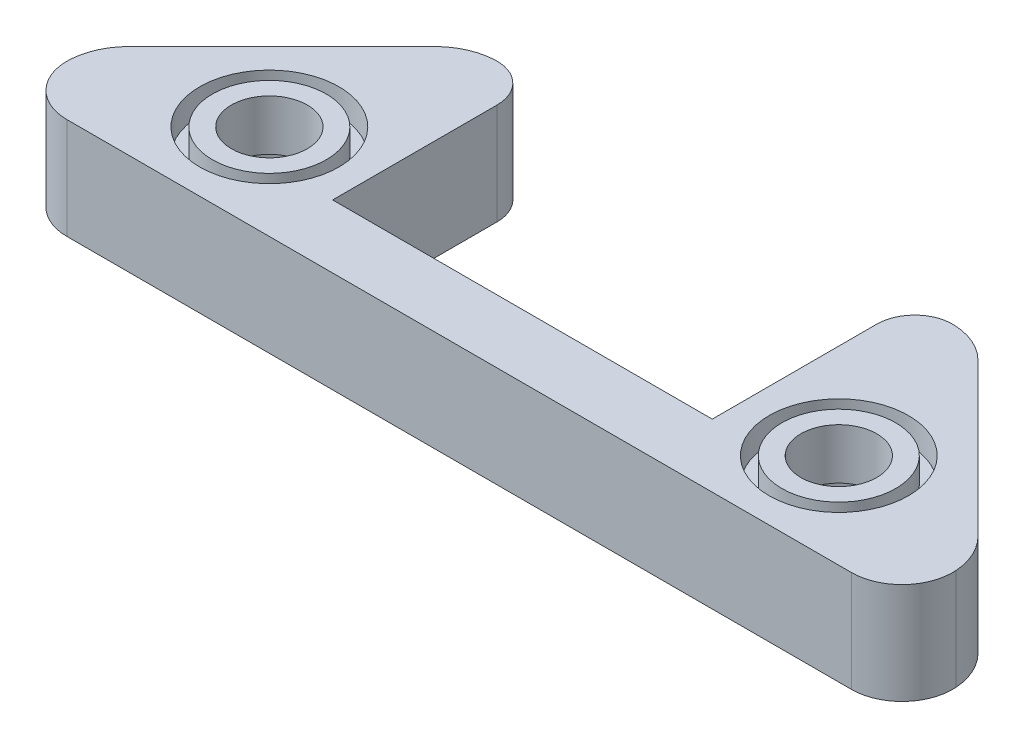
ISO-10303-21;
HEADER;
FILE_DESCRIPTION(('STEP AP214'),'2;1');
FILE_NAME('part.step','',(''),(''),'','','');
FILE_SCHEMA(('AUTOMOTIVE_DESIGN { 1 0 10303 214 1 1 1 1 }'));
ENDSEC;
DATA;
#1=APPLICATION_CONTEXT('core data for automotive mechanical design processes');
#2=APPLICATION_PROTOCOL_DEFINITION('international standard','automotive_design',2000,#1);
#3=PRODUCT_CONTEXT('',#1,'mechanical');
#4=PRODUCT('Part','Part','',(#3));
#5=PRODUCT_RELATED_PRODUCT_CATEGORY('part','',(#4));
#6=PRODUCT_DEFINITION_FORMATION('','',#4);
#7=PRODUCT_DEFINITION_CONTEXT('part definition',#1,'design');
#8=PRODUCT_DEFINITION('design','',#6,#7);
#9=PRODUCT_DEFINITION_SHAPE('','',#8);
#10=(LENGTH_UNIT() NAMED_UNIT(*) SI_UNIT(.MILLI.,.METRE.));
#11=(NAMED_UNIT(*) PLANE_ANGLE_UNIT() SI_UNIT($,.RADIAN.));
#12=(NAMED_UNIT(*) SI_UNIT($,.STERADIAN.) SOLID_ANGLE_UNIT());
#13=UNCERTAINTY_MEASURE_WITH_UNIT(LENGTH_MEASURE(1.E-05),#10,'distance_accuracy_value','');
#14=(GEOMETRIC_REPRESENTATION_CONTEXT(3) GLOBAL_UNCERTAINTY_ASSIGNED_CONTEXT((#13)) GLOBAL_UNIT_ASSIGNED_CONTEXT((#10,
#11,#12)) REPRESENTATION_CONTEXT('',''));
#15=CARTESIAN_POINT('',(0.,0.,0.));
#16=DIRECTION('',(0.,0.,1.));
#17=DIRECTION('',(1.,0.,0.));
#18=AXIS2_PLACEMENT_3D('',#15,#16,#17);
#19=CARTESIAN_POINT('',(0.,8.,0.));
#20=DIRECTION('',(0.,1.,0.));
#21=DIRECTION('',(0.,0.,1.));
#22=AXIS2_PLACEMENT_3D('',#19,#20,#21);
#23=PLANE('',#22);
#24=CARTESIAN_POINT('',(-22.5,8.,-7.49999999999999));
#25=DIRECTION('',(0.,1.,0.));
#26=DIRECTION('',(0.,0.,1.));
#27=AXIS2_PLACEMENT_3D('',#24,#25,#26);
#28=CIRCLE('',#27,3.);
#29=CARTESIAN_POINT('',(-22.5,8.,-4.49999999999999));
#30=VERTEX_POINT('',#29);
#31=EDGE_CURVE('E349',#30,#30,#28,.T.);
#32=ORIENTED_EDGE('',*,*,#31,.F.);
#33=EDGE_LOOP('',(#32));
#34=FACE_BOUND('',#33,.T.);
#35=CARTESIAN_POINT('',(-22.5,8.,-7.49999999999999));
#36=DIRECTION('',(0.,1.,0.));
#37=DIRECTION('',(0.,0.,1.));
#38=AXIS2_PLACEMENT_3D('',#35,#36,#37);
#39=CIRCLE('',#38,4.5);
#40=CARTESIAN_POINT('',(-22.5,8.,-2.99999999999999));
#41=VERTEX_POINT('',#40);
#42=EDGE_CURVE('E347',#41,#41,#39,.T.);
#43=ORIENTED_EDGE('',*,*,#42,.T.);
#44=EDGE_LOOP('',(#43));
#45=FACE_BOUND('',#44,.T.);
#46=ADVANCED_FACE('F43',(#34,#45),#23,.T.);
#47=CARTESIAN_POINT('',(22.5,8.,-7.49999999999999));
#48=DIRECTION('',(0.,1.,0.));
#49=DIRECTION('',(0.,0.,1.));
#50=AXIS2_PLACEMENT_3D('',#47,#48,#49);
#51=CIRCLE('',#50,3.);
#52=CARTESIAN_POINT('',(22.5,8.,-4.49999999999999));
#53=VERTEX_POINT('',#52);
#54=EDGE_CURVE('E186',#53,#53,#51,.T.);
#55=ORIENTED_EDGE('',*,*,#54,.F.);
#56=EDGE_LOOP('',(#55));
#57=FACE_BOUND('',#56,.T.);
#58=CARTESIAN_POINT('',(22.5,8.,-7.49999999999999));
#59=DIRECTION('',(0.,1.,0.));
#60=DIRECTION('',(0.,0.,1.));
#61=AXIS2_PLACEMENT_3D('',#58,#59,#60);
#62=CIRCLE('',#61,4.5);
#63=CARTESIAN_POINT('',(22.5,8.,-2.99999999999999));
#64=VERTEX_POINT('',#63);
#65=EDGE_CURVE('E339',#64,#64,#62,.T.);
#66=ORIENTED_EDGE('',*,*,#65,.T.);
#67=EDGE_LOOP('',(#66));
#68=FACE_BOUND('',#67,.T.);
#69=ADVANCED_FACE('F309',(#57,#68),#23,.T.);
#70=CARTESIAN_POINT('',(-22.5,8.,-7.49999999999999));
#71=DIRECTION('',(0.,1.,0.));
#72=DIRECTION('',(0.,0.,1.));
#73=AXIS2_PLACEMENT_3D('',#70,#71,#72);
#74=CIRCLE('',#73,5.5);
#75=CARTESIAN_POINT('',(-22.5,8.,-1.99999999999999));
#76=VERTEX_POINT('',#75);
#77=EDGE_CURVE('E331',#76,#76,#74,.T.);
#78=ORIENTED_EDGE('',*,*,#77,.F.);
#79=EDGE_LOOP('',(#78));
#80=FACE_BOUND('',#79,.T.);
#81=CARTESIAN_POINT('',(22.5,8.,-7.49999999999999));
#82=DIRECTION('',(0.,1.,0.));
#83=DIRECTION('',(0.,0.,1.));
#84=AXIS2_PLACEMENT_3D('',#81,#82,#83);
#85=CIRCLE('',#84,5.5);
#86=CARTESIAN_POINT('',(22.5,8.,-1.99999999999999));
#87=VERTEX_POINT('',#86);
#88=EDGE_CURVE('E334',#87,#87,#85,.T.);
#89=ORIENTED_EDGE('',*,*,#88,.F.);
#90=EDGE_LOOP('',(#89));
#91=FACE_BOUND('',#90,.T.);
#92=DIRECTION('',(1.,0.,0.));
#93=VECTOR('',#92,1.);
#94=CARTESIAN_POINT('',(-35.,8.,0.));
#95=LINE('',#94,#93);
#96=CARTESIAN_POINT('',(-30.9974714863677,8.,0.));
#97=VERTEX_POINT('',#96);
#98=CARTESIAN_POINT('',(30.9974714863677,8.,0.));
#99=VERTEX_POINT('',#98);
#100=EDGE_CURVE('E181',#97,#99,#95,.T.);
#101=ORIENTED_EDGE('',*,*,#100,.T.);
#102=CARTESIAN_POINT('',(30.9974714863677,8.,-4.));
#103=DIRECTION('',(0.,1.,0.));
#104=DIRECTION('',(0.,0.,1.));
#105=AXIS2_PLACEMENT_3D('',#102,#103,#104);
#106=CIRCLE('',#105,4.);
#107=CARTESIAN_POINT('',(34.9873574318387,8.,-4.28427124746183));
#108=VERTEX_POINT('',#107);
#109=EDGE_CURVE('E51',#99,#108,#106,.T.);
#110=ORIENTED_EDGE('',*,*,#109,.T.);
#111=CARTESIAN_POINT('',(30.,8.,-3.92893218813454));
#112=DIRECTION('',(0.,1.,0.));
#113=DIRECTION('',(0.,0.,1.));
#114=AXIS2_PLACEMENT_3D('',#111,#112,#113);
#115=CIRCLE('',#114,5.);
#116=CARTESIAN_POINT('',(33.5355339059327,8.,-7.46446609406729));
#117=VERTEX_POINT('',#116);
#118=EDGE_CURVE('E227',#108,#117,#115,.T.);
#119=ORIENTED_EDGE('',*,*,#118,.T.);
#120=DIRECTION('',(-0.707106781186548,0.,-0.707106781186547));
#121=VECTOR('',#120,1.);
#122=CARTESIAN_POINT('',(20.,8.,-21.));
#123=LINE('',#122,#121);
#124=CARTESIAN_POINT('',(21.4644660940673,8.,-19.5355339059327));
#125=VERTEX_POINT('',#124);
#126=EDGE_CURVE('E158',#117,#125,#123,.T.);
#127=ORIENTED_EDGE('',*,*,#126,.T.);
#128=CARTESIAN_POINT('',(17.9289321881345,8.,-16.));
#129=DIRECTION('',(0.,1.,0.));
#130=DIRECTION('',(0.,0.,1.));
#131=AXIS2_PLACEMENT_3D('',#128,#129,#130);
#132=CIRCLE('',#131,5.);
#133=CARTESIAN_POINT('',(18.1066017177982,8.,-20.9968423567518));
#134=VERTEX_POINT('',#133);
#135=EDGE_CURVE('E225',#125,#134,#132,.T.);
#136=ORIENTED_EDGE('',*,*,#135,.T.);
#137=CARTESIAN_POINT('',(18.,8.,-17.9987369427007));
#138=DIRECTION('',(0.,1.,0.));
#139=DIRECTION('',(0.,0.,1.));
#140=AXIS2_PLACEMENT_3D('',#137,#138,#139);
#141=CIRCLE('',#140,3.);
#142=CARTESIAN_POINT('',(15.,8.,-17.9987369427007));
#143=VERTEX_POINT('',#142);
#144=EDGE_CURVE('E154',#134,#143,#141,.T.);
#145=ORIENTED_EDGE('',*,*,#144,.T.);
#146=DIRECTION('',(0.,0.,1.));
#147=VECTOR('',#146,1.);
#148=CARTESIAN_POINT('',(15.,8.,-5.));
#149=LINE('',#148,#147);
#150=CARTESIAN_POINT('',(15.,8.,-5.));
#151=VERTEX_POINT('',#150);
#152=EDGE_CURVE('E145',#143,#151,#149,.T.);
#153=ORIENTED_EDGE('',*,*,#152,.T.);
#154=DIRECTION('',(-1.,0.,0.));
#155=VECTOR('',#154,1.);
#156=CARTESIAN_POINT('',(-15.,8.,-5.));
#157=LINE('',#156,#155);
#158=CARTESIAN_POINT('',(-15.,8.,-5.));
#159=VERTEX_POINT('',#158);
#160=EDGE_CURVE('E150',#151,#159,#157,.T.);
#161=ORIENTED_EDGE('',*,*,#160,.T.);
#162=DIRECTION('',(0.,0.,-1.));
#163=VECTOR('',#162,1.);
#164=CARTESIAN_POINT('',(-15.,8.,-21.));
#165=LINE('',#164,#163);
#166=CARTESIAN_POINT('',(-15.,8.,-17.9987369427007));
#167=VERTEX_POINT('',#166);
#168=EDGE_CURVE('E173',#159,#167,#165,.T.);
#169=ORIENTED_EDGE('',*,*,#168,.T.);
#170=CARTESIAN_POINT('',(-18.,8.,-17.9987369427007));
#171=DIRECTION('',(0.,1.,0.));
#172=DIRECTION('',(0.,0.,1.));
#173=AXIS2_PLACEMENT_3D('',#170,#171,#172);
#174=CIRCLE('',#173,3.);
#175=CARTESIAN_POINT('',(-18.1066017177982,8.,-20.9968423567518));
#176=VERTEX_POINT('',#175);
#177=EDGE_CURVE('E242',#167,#176,#174,.T.);
#178=ORIENTED_EDGE('',*,*,#177,.T.);
#179=CARTESIAN_POINT('',(-17.9289321881345,8.,-16.));
#180=DIRECTION('',(0.,1.,0.));
#181=DIRECTION('',(0.,0.,1.));
#182=AXIS2_PLACEMENT_3D('',#179,#180,#181);
#183=CIRCLE('',#182,5.);
#184=CARTESIAN_POINT('',(-21.4644660940673,8.,-19.5355339059327));
#185=VERTEX_POINT('',#184);
#186=EDGE_CURVE('E223',#176,#185,#183,.T.);
#187=ORIENTED_EDGE('',*,*,#186,.T.);
#188=DIRECTION('',(-0.707106781186547,0.,0.707106781186548));
#189=VECTOR('',#188,1.);
#190=CARTESIAN_POINT('',(-20.,8.,-21.));
#191=LINE('',#190,#189);
#192=CARTESIAN_POINT('',(-33.5355339059327,8.,-7.46446609406726));
#193=VERTEX_POINT('',#192);
#194=EDGE_CURVE('E175',#185,#193,#191,.T.);
#195=ORIENTED_EDGE('',*,*,#194,.T.);
#196=CARTESIAN_POINT('',(-30.,8.,-3.92893218813452));
#197=DIRECTION('',(0.,1.,0.));
#198=DIRECTION('',(0.,0.,1.));
#199=AXIS2_PLACEMENT_3D('',#196,#197,#198);
#200=CIRCLE('',#199,5.);
#201=CARTESIAN_POINT('',(-34.9873574318387,8.,-4.28427124746189));
#202=VERTEX_POINT('',#201);
#203=EDGE_CURVE('E221',#193,#202,#200,.T.);
#204=ORIENTED_EDGE('',*,*,#203,.T.);
#205=CARTESIAN_POINT('',(-30.9974714863677,8.,-4.));
#206=DIRECTION('',(0.,1.,0.));
#207=DIRECTION('',(0.,0.,1.));
#208=AXIS2_PLACEMENT_3D('',#205,#206,#207);
#209=CIRCLE('',#208,4.);
#210=EDGE_CURVE('E261',#202,#97,#209,.T.);
#211=ORIENTED_EDGE('',*,*,#210,.T.);
#212=EDGE_LOOP('',(#101,#110,#119,#127,#136,#145,#153,#161,#169,#178,#187,#195,#204,#211));
#213=FACE_BOUND('',#212,.T.);
#214=ADVANCED_FACE('F147',(#80,#91,#213),#23,.T.);
#215=CARTESIAN_POINT('',(0.,0.,0.));
#216=DIRECTION('',(0.,1.,0.));
#217=DIRECTION('',(0.,0.,1.));
#218=AXIS2_PLACEMENT_3D('',#215,#216,#217);
#219=PLANE('',#218);
#220=CARTESIAN_POINT('',(-22.5,0.,-7.49999999999999));
#221=DIRECTION('',(0.,-1.,0.));
#222=DIRECTION('',(0.,0.,-1.));
#223=AXIS2_PLACEMENT_3D('',#220,#221,#222);
#224=CIRCLE('',#223,6.1);
#225=CARTESIAN_POINT('',(-22.5,0.,-13.6));
#226=VERTEX_POINT('',#225);
#227=EDGE_CURVE('E614',#226,#226,#224,.T.);
#228=ORIENTED_EDGE('',*,*,#227,.F.);
#229=EDGE_LOOP('',(#228));
#230=FACE_BOUND('',#229,.T.);
#231=CARTESIAN_POINT('',(22.5,0.,-7.49999999999999));
#232=DIRECTION('',(0.,-1.,0.));
#233=DIRECTION('',(0.,0.,-1.));
#234=AXIS2_PLACEMENT_3D('',#231,#232,#233);
#235=CIRCLE('',#234,6.1);
#236=CARTESIAN_POINT('',(22.5,0.,-13.6));
#237=VERTEX_POINT('',#236);
#238=EDGE_CURVE('E611',#237,#237,#235,.T.);
#239=ORIENTED_EDGE('',*,*,#238,.F.);
#240=EDGE_LOOP('',(#239));
#241=FACE_BOUND('',#240,.T.);
#242=CARTESIAN_POINT('',(30.,0.,-3.92893218813454));
#243=DIRECTION('',(0.,1.,0.));
#244=DIRECTION('',(0.,0.,1.));
#245=AXIS2_PLACEMENT_3D('',#242,#243,#244);
#246=CIRCLE('',#245,5.);
#247=CARTESIAN_POINT('',(33.5355339059327,0.,-7.46446609406729));
#248=VERTEX_POINT('',#247);
#249=CARTESIAN_POINT('',(34.9873574318387,0.,-4.28427124746183));
#250=VERTEX_POINT('',#249);
#251=EDGE_CURVE('E218',#248,#250,#246,.F.);
#252=ORIENTED_EDGE('',*,*,#251,.T.);
#253=CARTESIAN_POINT('',(30.9974714863677,0.,-4.));
#254=DIRECTION('',(0.,1.,0.));
#255=DIRECTION('',(0.,0.,1.));
#256=AXIS2_PLACEMENT_3D('',#253,#254,#255);
#257=CIRCLE('',#256,4.);
#258=CARTESIAN_POINT('',(30.9974714863677,0.,0.));
#259=VERTEX_POINT('',#258);
#260=EDGE_CURVE('E255',#250,#259,#257,.F.);
#261=ORIENTED_EDGE('',*,*,#260,.T.);
#262=DIRECTION('',(1.,0.,0.));
#263=VECTOR('',#262,1.);
#264=CARTESIAN_POINT('',(-35.,0.,0.));
#265=LINE('',#264,#263);
#266=CARTESIAN_POINT('',(-30.9974714863677,0.,0.));
#267=VERTEX_POINT('',#266);
#268=EDGE_CURVE('E196',#267,#259,#265,.T.);
#269=ORIENTED_EDGE('',*,*,#268,.F.);
#270=CARTESIAN_POINT('',(-30.9974714863677,0.,-4.));
#271=DIRECTION('',(0.,1.,0.));
#272=DIRECTION('',(0.,0.,1.));
#273=AXIS2_PLACEMENT_3D('',#270,#271,#272);
#274=CIRCLE('',#273,4.);
#275=CARTESIAN_POINT('',(-34.9873574318387,0.,-4.28427124746189));
#276=VERTEX_POINT('',#275);
#277=EDGE_CURVE('E253',#267,#276,#274,.F.);
#278=ORIENTED_EDGE('',*,*,#277,.T.);
#279=CARTESIAN_POINT('',(-30.,0.,-3.92893218813452));
#280=DIRECTION('',(0.,1.,0.));
#281=DIRECTION('',(0.,0.,1.));
#282=AXIS2_PLACEMENT_3D('',#279,#280,#281);
#283=CIRCLE('',#282,5.);
#284=CARTESIAN_POINT('',(-33.5355339059327,0.,-7.46446609406726));
#285=VERTEX_POINT('',#284);
#286=EDGE_CURVE('E211',#276,#285,#283,.F.);
#287=ORIENTED_EDGE('',*,*,#286,.T.);
#288=DIRECTION('',(-0.707106781186547,0.,0.707106781186548));
#289=VECTOR('',#288,1.);
#290=CARTESIAN_POINT('',(-20.,0.,-21.));
#291=LINE('',#290,#289);
#292=CARTESIAN_POINT('',(-21.4644660940673,0.,-19.5355339059327));
#293=VERTEX_POINT('',#292);
#294=EDGE_CURVE('E193',#293,#285,#291,.T.);
#295=ORIENTED_EDGE('',*,*,#294,.F.);
#296=CARTESIAN_POINT('',(-17.9289321881345,0.,-16.));
#297=DIRECTION('',(0.,1.,0.));
#298=DIRECTION('',(0.,0.,1.));
#299=AXIS2_PLACEMENT_3D('',#296,#297,#298);
#300=CIRCLE('',#299,5.);
#301=CARTESIAN_POINT('',(-18.1066017177982,0.,-20.9968423567518));
#302=VERTEX_POINT('',#301);
#303=EDGE_CURVE('E213',#293,#302,#300,.F.);
#304=ORIENTED_EDGE('',*,*,#303,.T.);
#305=CARTESIAN_POINT('',(-18.,0.,-17.9987369427007));
#306=DIRECTION('',(0.,1.,0.));
#307=DIRECTION('',(0.,0.,1.));
#308=AXIS2_PLACEMENT_3D('',#305,#306,#307);
#309=CIRCLE('',#308,3.);
#310=CARTESIAN_POINT('',(-15.,0.,-17.9987369427007));
#311=VERTEX_POINT('',#310);
#312=EDGE_CURVE('E236',#302,#311,#309,.F.);
#313=ORIENTED_EDGE('',*,*,#312,.T.);
#314=DIRECTION('',(0.,0.,-1.));
#315=VECTOR('',#314,1.);
#316=CARTESIAN_POINT('',(-15.,0.,-21.));
#317=LINE('',#316,#315);
#318=CARTESIAN_POINT('',(-15.,0.,-5.));
#319=VERTEX_POINT('',#318);
#320=EDGE_CURVE('E190',#319,#311,#317,.T.);
#321=ORIENTED_EDGE('',*,*,#320,.F.);
#322=DIRECTION('',(-1.,0.,0.));
#323=VECTOR('',#322,1.);
#324=CARTESIAN_POINT('',(-15.,0.,-5.));
#325=LINE('',#324,#323);
#326=CARTESIAN_POINT('',(15.,0.,-5.));
#327=VERTEX_POINT('',#326);
#328=EDGE_CURVE('E188',#327,#319,#325,.T.);
#329=ORIENTED_EDGE('',*,*,#328,.F.);
#330=DIRECTION('',(0.,0.,1.));
#331=VECTOR('',#330,1.);
#332=CARTESIAN_POINT('',(15.,0.,-5.));
#333=LINE('',#332,#331);
#334=CARTESIAN_POINT('',(15.,0.,-17.9987369427007));
#335=VERTEX_POINT('',#334);
#336=EDGE_CURVE('E164',#335,#327,#333,.T.);
#337=ORIENTED_EDGE('',*,*,#336,.F.);
#338=CARTESIAN_POINT('',(18.,0.,-17.9987369427007));
#339=DIRECTION('',(0.,1.,0.));
#340=DIRECTION('',(0.,0.,1.));
#341=AXIS2_PLACEMENT_3D('',#338,#339,#340);
#342=CIRCLE('',#341,3.);
#343=CARTESIAN_POINT('',(18.1066017177982,0.,-20.9968423567518));
#344=VERTEX_POINT('',#343);
#345=EDGE_CURVE('E238',#335,#344,#342,.F.);
#346=ORIENTED_EDGE('',*,*,#345,.T.);
#347=CARTESIAN_POINT('',(17.9289321881345,0.,-16.));
#348=DIRECTION('',(0.,1.,0.));
#349=DIRECTION('',(0.,0.,1.));
#350=AXIS2_PLACEMENT_3D('',#347,#348,#349);
#351=CIRCLE('',#350,5.);
#352=CARTESIAN_POINT('',(21.4644660940673,0.,-19.5355339059327));
#353=VERTEX_POINT('',#352);
#354=EDGE_CURVE('E216',#344,#353,#351,.F.);
#355=ORIENTED_EDGE('',*,*,#354,.T.);
#356=DIRECTION('',(-0.707106781186548,0.,-0.707106781186547));
#357=VECTOR('',#356,1.);
#358=CARTESIAN_POINT('',(20.,0.,-21.));
#359=LINE('',#358,#357);
#360=EDGE_CURVE('E183',#248,#353,#359,.T.);
#361=ORIENTED_EDGE('',*,*,#360,.F.);
#362=EDGE_LOOP('',(#252,#261,#269,#278,#287,#295,#304,#313,#321,#329,#337,#346,#355,#361));
#363=FACE_BOUND('',#362,.T.);
#364=ADVANCED_FACE('F274',(#230,#241,#363),#219,.F.);
#365=CARTESIAN_POINT('',(20.,8.,-21.));
#366=DIRECTION('',(-0.707106781186547,0.,0.707106781186548));
#367=DIRECTION('',(0.707106781186548,0.,0.707106781186547));
#368=AXIS2_PLACEMENT_3D('',#365,#366,#367);
#369=PLANE('',#368);
#370=ORIENTED_EDGE('',*,*,#126,.F.);
#371=DIRECTION('',(0.,-1.,0.));
#372=VECTOR('',#371,1.);
#373=CARTESIAN_POINT('',(33.5355339059327,8.,-7.46446609406728));
#374=LINE('',#373,#372);
#375=EDGE_CURVE('E208',#117,#248,#374,.T.);
#376=ORIENTED_EDGE('',*,*,#375,.T.);
#377=ORIENTED_EDGE('',*,*,#360,.T.);
#378=DIRECTION('',(0.,-1.,0.));
#379=VECTOR('',#378,1.);
#380=CARTESIAN_POINT('',(21.4644660940673,8.,-19.5355339059327));
#381=LINE('',#380,#379);
#382=EDGE_CURVE('E167',#353,#125,#381,.F.);
#383=ORIENTED_EDGE('',*,*,#382,.T.);
#384=EDGE_LOOP('',(#370,#376,#377,#383));
#385=FACE_BOUND('',#384,.T.);
#386=ADVANCED_FACE('F326',(#385),#369,.F.);
#387=CARTESIAN_POINT('',(15.,8.,-5.));
#388=DIRECTION('',(1.,0.,0.));
#389=DIRECTION('',(0.,0.,-1.));
#390=AXIS2_PLACEMENT_3D('',#387,#388,#389);
#391=PLANE('',#390);
#392=ORIENTED_EDGE('',*,*,#152,.F.);
#393=DIRECTION('',(0.,1.,0.));
#394=VECTOR('',#393,1.);
#395=CARTESIAN_POINT('',(15.,0.,-17.9987369427007));
#396=LINE('',#395,#394);
#397=EDGE_CURVE('E234',#143,#335,#396,.F.);
#398=ORIENTED_EDGE('',*,*,#397,.T.);
#399=ORIENTED_EDGE('',*,*,#336,.T.);
#400=DIRECTION('',(0.,-1.,0.));
#401=VECTOR('',#400,1.);
#402=CARTESIAN_POINT('',(15.,8.,-5.));
#403=LINE('',#402,#401);
#404=EDGE_CURVE('E161',#151,#327,#403,.T.);
#405=ORIENTED_EDGE('',*,*,#404,.F.);
#406=EDGE_LOOP('',(#392,#398,#399,#405));
#407=FACE_BOUND('',#406,.T.);
#408=ADVANCED_FACE('F162',(#407),#391,.F.);
#409=CARTESIAN_POINT('',(-15.,8.,-5.));
#410=DIRECTION('',(0.,0.,1.));
#411=DIRECTION('',(1.,0.,0.));
#412=AXIS2_PLACEMENT_3D('',#409,#410,#411);
#413=PLANE('',#412);
#414=ORIENTED_EDGE('',*,*,#328,.T.);
#415=DIRECTION('',(0.,-1.,0.));
#416=VECTOR('',#415,1.);
#417=CARTESIAN_POINT('',(-15.,8.,-5.));
#418=LINE('',#417,#416);
#419=EDGE_CURVE('E168',#159,#319,#418,.T.);
#420=ORIENTED_EDGE('',*,*,#419,.F.);
#421=ORIENTED_EDGE('',*,*,#160,.F.);
#422=ORIENTED_EDGE('',*,*,#404,.T.);
#423=EDGE_LOOP('',(#414,#420,#421,#422));
#424=FACE_BOUND('',#423,.T.);
#425=ADVANCED_FACE('F170',(#424),#413,.F.);
#426=CARTESIAN_POINT('',(-15.,8.,-21.));
#427=DIRECTION('',(-1.,0.,0.));
#428=DIRECTION('',(0.,0.,1.));
#429=AXIS2_PLACEMENT_3D('',#426,#427,#428);
#430=PLANE('',#429);
#431=ORIENTED_EDGE('',*,*,#320,.T.);
#432=DIRECTION('',(0.,1.,0.));
#433=VECTOR('',#432,1.);
#434=CARTESIAN_POINT('',(-15.,8.,-17.9987369427007));
#435=LINE('',#434,#433);
#436=EDGE_CURVE('E248',#311,#167,#435,.T.);
#437=ORIENTED_EDGE('',*,*,#436,.T.);
#438=ORIENTED_EDGE('',*,*,#168,.F.);
#439=ORIENTED_EDGE('',*,*,#419,.T.);
#440=EDGE_LOOP('',(#431,#437,#438,#439));
#441=FACE_BOUND('',#440,.T.);
#442=ADVANCED_FACE('F297',(#441),#430,.F.);
#443=CARTESIAN_POINT('',(-20.,8.,-21.));
#444=DIRECTION('',(0.707106781186548,0.,0.707106781186547));
#445=DIRECTION('',(0.707106781186547,0.,-0.707106781186548));
#446=AXIS2_PLACEMENT_3D('',#443,#444,#445);
#447=PLANE('',#446);
#448=ORIENTED_EDGE('',*,*,#194,.F.);
#449=DIRECTION('',(0.,-1.,0.));
#450=VECTOR('',#449,1.);
#451=CARTESIAN_POINT('',(-21.4644660940673,8.,-19.5355339059327));
#452=LINE('',#451,#450);
#453=EDGE_CURVE('E231',#185,#293,#452,.T.);
#454=ORIENTED_EDGE('',*,*,#453,.T.);
#455=ORIENTED_EDGE('',*,*,#294,.T.);
#456=DIRECTION('',(0.,-1.,0.));
#457=VECTOR('',#456,1.);
#458=CARTESIAN_POINT('',(-33.5355339059327,8.,-7.46446609406726));
#459=LINE('',#458,#457);
#460=EDGE_CURVE('E229',#285,#193,#459,.F.);
#461=ORIENTED_EDGE('',*,*,#460,.T.);
#462=EDGE_LOOP('',(#448,#454,#455,#461));
#463=FACE_BOUND('',#462,.T.);
#464=ADVANCED_FACE('F285',(#463),#447,.F.);
#465=CARTESIAN_POINT('',(-35.,8.,0.));
#466=DIRECTION('',(0.,0.,-1.));
#467=DIRECTION('',(-1.,0.,0.));
#468=AXIS2_PLACEMENT_3D('',#465,#466,#467);
#469=PLANE('',#468);
#470=ORIENTED_EDGE('',*,*,#268,.T.);
#471=DIRECTION('',(0.,1.,0.));
#472=VECTOR('',#471,1.);
#473=CARTESIAN_POINT('',(30.9974714863677,8.,0.));
#474=LINE('',#473,#472);
#475=EDGE_CURVE('E64',#259,#99,#474,.T.);
#476=ORIENTED_EDGE('',*,*,#475,.T.);
#477=ORIENTED_EDGE('',*,*,#100,.F.);
#478=DIRECTION('',(0.,1.,0.));
#479=VECTOR('',#478,1.);
#480=CARTESIAN_POINT('',(-30.9974714863677,0.,0.));
#481=LINE('',#480,#479);
#482=EDGE_CURVE('E257',#97,#267,#481,.F.);
#483=ORIENTED_EDGE('',*,*,#482,.T.);
#484=EDGE_LOOP('',(#470,#476,#477,#483));
#485=FACE_BOUND('',#484,.T.);
#486=ADVANCED_FACE('F276',(#485),#469,.F.);
#487=CARTESIAN_POINT('',(22.5,8.,-7.49999999999999));
#488=DIRECTION('',(0.,-1.,0.));
#489=DIRECTION('',(0.,0.,-1.));
#490=AXIS2_PLACEMENT_3D('',#487,#488,#489);
#491=CYLINDRICAL_SURFACE('',#490,3.);
#492=CARTESIAN_POINT('',(22.5,4.,-7.49999999999999));
#493=DIRECTION('',(0.,1.,0.));
#494=DIRECTION('',(0.,0.,1.));
#495=AXIS2_PLACEMENT_3D('',#492,#493,#494);
#496=CIRCLE('',#495,3.);
#497=CARTESIAN_POINT('',(22.5,4.,-4.49999999999999));
#498=VERTEX_POINT('',#497);
#499=EDGE_CURVE('E202',#498,#498,#496,.T.);
#500=ORIENTED_EDGE('',*,*,#499,.F.);
#501=EDGE_LOOP('',(#500));
#502=FACE_BOUND('',#501,.T.);
#503=ORIENTED_EDGE('',*,*,#54,.T.);
#504=EDGE_LOOP('',(#503));
#505=FACE_BOUND('',#504,.T.);
#506=ADVANCED_FACE('F546',(#502,#505),#491,.F.);
#507=CARTESIAN_POINT('',(-22.5,8.,-7.49999999999999));
#508=DIRECTION('',(0.,-1.,0.));
#509=DIRECTION('',(0.,0.,-1.));
#510=AXIS2_PLACEMENT_3D('',#507,#508,#509);
#511=CYLINDRICAL_SURFACE('',#510,3.);
#512=CARTESIAN_POINT('',(-22.5,4.,-7.49999999999999));
#513=DIRECTION('',(0.,1.,0.));
#514=DIRECTION('',(0.,0.,1.));
#515=AXIS2_PLACEMENT_3D('',#512,#513,#514);
#516=CIRCLE('',#515,3.);
#517=CARTESIAN_POINT('',(-22.5,4.,-4.49999999999999));
#518=VERTEX_POINT('',#517);
#519=EDGE_CURVE('E199',#518,#518,#516,.T.);
#520=ORIENTED_EDGE('',*,*,#519,.F.);
#521=EDGE_LOOP('',(#520));
#522=FACE_BOUND('',#521,.T.);
#523=ORIENTED_EDGE('',*,*,#31,.T.);
#524=EDGE_LOOP('',(#523));
#525=FACE_BOUND('',#524,.T.);
#526=ADVANCED_FACE('F528',(#522,#525),#511,.F.);
#527=CARTESIAN_POINT('',(22.5,6.,-7.49999999999999));
#528=DIRECTION('',(0.,1.,0.));
#529=DIRECTION('',(0.,0.,1.));
#530=AXIS2_PLACEMENT_3D('',#527,#528,#529);
#531=CYLINDRICAL_SURFACE('',#530,5.5);
#532=CARTESIAN_POINT('',(22.5,6.,-7.49999999999999));
#533=DIRECTION('',(0.,1.,0.));
#534=DIRECTION('',(0.,0.,1.));
#535=AXIS2_PLACEMENT_3D('',#532,#533,#534);
#536=CIRCLE('',#535,5.5);
#537=CARTESIAN_POINT('',(22.5,6.,-1.99999999999999));
#538=VERTEX_POINT('',#537);
#539=EDGE_CURVE('E206',#538,#538,#536,.T.);
#540=ORIENTED_EDGE('',*,*,#539,.F.);
#541=EDGE_LOOP('',(#540));
#542=FACE_BOUND('',#541,.T.);
#543=ORIENTED_EDGE('',*,*,#88,.T.);
#544=EDGE_LOOP('',(#543));
#545=FACE_BOUND('',#544,.T.);
#546=ADVANCED_FACE('F518',(#542,#545),#531,.F.);
#547=CARTESIAN_POINT('',(22.5,6.,-7.49999999999999));
#548=DIRECTION('',(0.,1.,0.));
#549=DIRECTION('',(0.,0.,1.));
#550=AXIS2_PLACEMENT_3D('',#547,#548,#549);
#551=PLANE('',#550);
#552=CARTESIAN_POINT('',(22.5,6.,-7.49999999999999));
#553=DIRECTION('',(0.,1.,0.));
#554=DIRECTION('',(0.,0.,1.));
#555=AXIS2_PLACEMENT_3D('',#552,#553,#554);
#556=CIRCLE('',#555,4.5);
#557=CARTESIAN_POINT('',(22.5,6.,-2.99999999999999));
#558=VERTEX_POINT('',#557);
#559=EDGE_CURVE('E336',#558,#558,#556,.T.);
#560=ORIENTED_EDGE('',*,*,#559,.F.);
#561=EDGE_LOOP('',(#560));
#562=FACE_BOUND('',#561,.T.);
#563=ORIENTED_EDGE('',*,*,#539,.T.);
#564=EDGE_LOOP('',(#563));
#565=FACE_BOUND('',#564,.T.);
#566=ADVANCED_FACE('F508',(#562,#565),#551,.T.);
#567=CARTESIAN_POINT('',(22.5,6.,-7.49999999999999));
#568=DIRECTION('',(0.,1.,0.));
#569=DIRECTION('',(0.,0.,1.));
#570=AXIS2_PLACEMENT_3D('',#567,#568,#569);
#571=CYLINDRICAL_SURFACE('',#570,4.5);
#572=ORIENTED_EDGE('',*,*,#559,.T.);
#573=EDGE_LOOP('',(#572));
#574=FACE_BOUND('',#573,.T.);
#575=ORIENTED_EDGE('',*,*,#65,.F.);
#576=EDGE_LOOP('',(#575));
#577=FACE_BOUND('',#576,.T.);
#578=ADVANCED_FACE('F498',(#574,#577),#571,.T.);
#579=CARTESIAN_POINT('',(-22.5,6.,-7.49999999999999));
#580=DIRECTION('',(0.,1.,0.));
#581=DIRECTION('',(0.,0.,1.));
#582=AXIS2_PLACEMENT_3D('',#579,#580,#581);
#583=CYLINDRICAL_SURFACE('',#582,5.5);
#584=CARTESIAN_POINT('',(-22.5,6.,-7.49999999999999));
#585=DIRECTION('',(0.,1.,0.));
#586=DIRECTION('',(0.,0.,1.));
#587=AXIS2_PLACEMENT_3D('',#584,#585,#586);
#588=CIRCLE('',#587,5.5);
#589=CARTESIAN_POINT('',(-22.5,6.,-1.99999999999999));
#590=VERTEX_POINT('',#589);
#591=EDGE_CURVE('E352',#590,#590,#588,.T.);
#592=ORIENTED_EDGE('',*,*,#591,.F.);
#593=EDGE_LOOP('',(#592));
#594=FACE_BOUND('',#593,.T.);
#595=ORIENTED_EDGE('',*,*,#77,.T.);
#596=EDGE_LOOP('',(#595));
#597=FACE_BOUND('',#596,.T.);
#598=ADVANCED_FACE('F488',(#594,#597),#583,.F.);
#599=CARTESIAN_POINT('',(-22.5,6.,-7.49999999999999));
#600=DIRECTION('',(0.,1.,0.));
#601=DIRECTION('',(0.,0.,1.));
#602=AXIS2_PLACEMENT_3D('',#599,#600,#601);
#603=PLANE('',#602);
#604=CARTESIAN_POINT('',(-22.5,6.,-7.49999999999999));
#605=DIRECTION('',(0.,1.,0.));
#606=DIRECTION('',(0.,0.,1.));
#607=AXIS2_PLACEMENT_3D('',#604,#605,#606);
#608=CIRCLE('',#607,4.5);
#609=CARTESIAN_POINT('',(-22.5,6.,-2.99999999999999));
#610=VERTEX_POINT('',#609);
#611=EDGE_CURVE('E619',#610,#610,#608,.T.);
#612=ORIENTED_EDGE('',*,*,#611,.F.);
#613=EDGE_LOOP('',(#612));
#614=FACE_BOUND('',#613,.T.);
#615=ORIENTED_EDGE('',*,*,#591,.T.);
#616=EDGE_LOOP('',(#615));
#617=FACE_BOUND('',#616,.T.);
#618=ADVANCED_FACE('F477',(#614,#617),#603,.T.);
#619=CARTESIAN_POINT('',(-22.5,6.,-7.49999999999999));
#620=DIRECTION('',(0.,1.,0.));
#621=DIRECTION('',(0.,0.,1.));
#622=AXIS2_PLACEMENT_3D('',#619,#620,#621);
#623=CYLINDRICAL_SURFACE('',#622,4.5);
#624=ORIENTED_EDGE('',*,*,#611,.T.);
#625=EDGE_LOOP('',(#624));
#626=FACE_BOUND('',#625,.T.);
#627=ORIENTED_EDGE('',*,*,#42,.F.);
#628=EDGE_LOOP('',(#627));
#629=FACE_BOUND('',#628,.T.);
#630=ADVANCED_FACE('F466',(#626,#629),#623,.T.);
#631=CARTESIAN_POINT('',(-22.5,4.,-7.49999999999999));
#632=DIRECTION('',(0.,1.,0.));
#633=DIRECTION('',(0.,0.,1.));
#634=AXIS2_PLACEMENT_3D('',#631,#632,#633);
#635=PLANE('',#634);
#636=ORIENTED_EDGE('',*,*,#519,.T.);
#637=EDGE_LOOP('',(#636));
#638=FACE_BOUND('',#637,.T.);
#639=CARTESIAN_POINT('',(-22.5,4.,-7.49999999999999));
#640=DIRECTION('',(0.,1.,0.));
#641=DIRECTION('',(0.,0.,1.));
#642=AXIS2_PLACEMENT_3D('',#639,#640,#641);
#643=CIRCLE('',#642,6.1);
#644=CARTESIAN_POINT('',(-22.5,4.,-1.39999999999999));
#645=VERTEX_POINT('',#644);
#646=EDGE_CURVE('E203',#645,#645,#643,.F.);
#647=ORIENTED_EDGE('',*,*,#646,.T.);
#648=EDGE_LOOP('',(#647));
#649=FACE_BOUND('',#648,.T.);
#650=ADVANCED_FACE('F456',(#638,#649),#635,.F.);
#651=CARTESIAN_POINT('',(-22.5,23.2534054609518,-7.49999999999999));
#652=DIRECTION('',(0.,-1.,0.));
#653=DIRECTION('',(0.,0.,-1.));
#654=AXIS2_PLACEMENT_3D('',#651,#652,#653);
#655=CYLINDRICAL_SURFACE('',#654,6.1);
#656=ORIENTED_EDGE('',*,*,#227,.T.);
#657=EDGE_LOOP('',(#656));
#658=FACE_BOUND('',#657,.T.);
#659=ORIENTED_EDGE('',*,*,#646,.F.);
#660=EDGE_LOOP('',(#659));
#661=FACE_BOUND('',#660,.T.);
#662=ADVANCED_FACE('F446',(#658,#661),#655,.F.);
#663=CARTESIAN_POINT('',(-22.5,4.,-7.49999999999999));
#664=DIRECTION('',(0.,1.,0.));
#665=DIRECTION('',(0.,0.,1.));
#666=AXIS2_PLACEMENT_3D('',#663,#664,#665);
#667=PLANE('',#666);
#668=ORIENTED_EDGE('',*,*,#499,.T.);
#669=EDGE_LOOP('',(#668));
#670=FACE_BOUND('',#669,.T.);
#671=CARTESIAN_POINT('',(22.5,4.,-7.49999999999999));
#672=DIRECTION('',(0.,1.,0.));
#673=DIRECTION('',(0.,0.,1.));
#674=AXIS2_PLACEMENT_3D('',#671,#672,#673);
#675=CIRCLE('',#674,6.1);
#676=CARTESIAN_POINT('',(22.5,4.,-1.39999999999999));
#677=VERTEX_POINT('',#676);
#678=EDGE_CURVE('E609',#677,#677,#675,.F.);
#679=ORIENTED_EDGE('',*,*,#678,.T.);
#680=EDGE_LOOP('',(#679));
#681=FACE_BOUND('',#680,.T.);
#682=ADVANCED_FACE('F436',(#670,#681),#667,.F.);
#683=CARTESIAN_POINT('',(22.5,23.2534054609518,-7.49999999999999));
#684=DIRECTION('',(0.,-1.,0.));
#685=DIRECTION('',(0.,0.,-1.));
#686=AXIS2_PLACEMENT_3D('',#683,#684,#685);
#687=CYLINDRICAL_SURFACE('',#686,6.1);
#688=ORIENTED_EDGE('',*,*,#238,.T.);
#689=EDGE_LOOP('',(#688));
#690=FACE_BOUND('',#689,.T.);
#691=ORIENTED_EDGE('',*,*,#678,.F.);
#692=EDGE_LOOP('',(#691));
#693=FACE_BOUND('',#692,.T.);
#694=ADVANCED_FACE('F372',(#690,#693),#687,.F.);
#695=CARTESIAN_POINT('',(30.,8.,-3.92893218813454));
#696=DIRECTION('',(0.,-1.,0.));
#697=DIRECTION('',(0.,0.,-1.));
#698=AXIS2_PLACEMENT_3D('',#695,#696,#697);
#699=CYLINDRICAL_SURFACE('',#698,5.);
#700=ORIENTED_EDGE('',*,*,#118,.F.);
#701=DIRECTION('',(0.,-1.,0.));
#702=VECTOR('',#701,1.);
#703=CARTESIAN_POINT('',(34.9873574318387,8.,-4.28427124746183));
#704=LINE('',#703,#702);
#705=EDGE_CURVE('E250',#108,#250,#704,.T.);
#706=ORIENTED_EDGE('',*,*,#705,.T.);
#707=ORIENTED_EDGE('',*,*,#251,.F.);
#708=ORIENTED_EDGE('',*,*,#375,.F.);
#709=EDGE_LOOP('',(#700,#706,#707,#708));
#710=FACE_BOUND('',#709,.T.);
#711=ADVANCED_FACE('F270',(#710),#699,.T.);
#712=CARTESIAN_POINT('',(17.9289321881345,8.,-16.));
#713=DIRECTION('',(0.,-1.,0.));
#714=DIRECTION('',(0.,0.,-1.));
#715=AXIS2_PLACEMENT_3D('',#712,#713,#714);
#716=CYLINDRICAL_SURFACE('',#715,5.);
#717=ORIENTED_EDGE('',*,*,#354,.F.);
#718=DIRECTION('',(0.,-1.,0.));
#719=VECTOR('',#718,1.);
#720=CARTESIAN_POINT('',(18.1066017177982,8.,-20.9968423567518));
#721=LINE('',#720,#719);
#722=EDGE_CURVE('E240',#344,#134,#721,.F.);
#723=ORIENTED_EDGE('',*,*,#722,.T.);
#724=ORIENTED_EDGE('',*,*,#135,.F.);
#725=ORIENTED_EDGE('',*,*,#382,.F.);
#726=EDGE_LOOP('',(#717,#723,#724,#725));
#727=FACE_BOUND('',#726,.T.);
#728=ADVANCED_FACE('F359',(#727),#716,.T.);
#729=CARTESIAN_POINT('',(-17.9289321881345,8.,-16.));
#730=DIRECTION('',(0.,-1.,0.));
#731=DIRECTION('',(0.,0.,-1.));
#732=AXIS2_PLACEMENT_3D('',#729,#730,#731);
#733=CYLINDRICAL_SURFACE('',#732,5.);
#734=ORIENTED_EDGE('',*,*,#186,.F.);
#735=DIRECTION('',(0.,-1.,0.));
#736=VECTOR('',#735,1.);
#737=CARTESIAN_POINT('',(-18.1066017177982,8.,-20.9968423567518));
#738=LINE('',#737,#736);
#739=EDGE_CURVE('E245',#176,#302,#738,.T.);
#740=ORIENTED_EDGE('',*,*,#739,.T.);
#741=ORIENTED_EDGE('',*,*,#303,.F.);
#742=ORIENTED_EDGE('',*,*,#453,.F.);
#743=EDGE_LOOP('',(#734,#740,#741,#742));
#744=FACE_BOUND('',#743,.T.);
#745=ADVANCED_FACE('F291',(#744),#733,.T.);
#746=CARTESIAN_POINT('',(-30.,8.,-3.92893218813452));
#747=DIRECTION('',(0.,-1.,0.));
#748=DIRECTION('',(0.,0.,-1.));
#749=AXIS2_PLACEMENT_3D('',#746,#747,#748);
#750=CYLINDRICAL_SURFACE('',#749,5.);
#751=ORIENTED_EDGE('',*,*,#286,.F.);
#752=DIRECTION('',(0.,-1.,0.));
#753=VECTOR('',#752,1.);
#754=CARTESIAN_POINT('',(-34.9873574318387,8.,-4.28427124746189));
#755=LINE('',#754,#753);
#756=EDGE_CURVE('E12',#276,#202,#755,.F.);
#757=ORIENTED_EDGE('',*,*,#756,.T.);
#758=ORIENTED_EDGE('',*,*,#203,.F.);
#759=ORIENTED_EDGE('',*,*,#460,.F.);
#760=EDGE_LOOP('',(#751,#757,#758,#759));
#761=FACE_BOUND('',#760,.T.);
#762=ADVANCED_FACE('F282',(#761),#750,.T.);
#763=CARTESIAN_POINT('',(18.,8.,-17.9987369427007));
#764=DIRECTION('',(0.,-1.,0.));
#765=DIRECTION('',(0.,0.,-1.));
#766=AXIS2_PLACEMENT_3D('',#763,#764,#765);
#767=CYLINDRICAL_SURFACE('',#766,3.);
#768=ORIENTED_EDGE('',*,*,#144,.F.);
#769=ORIENTED_EDGE('',*,*,#722,.F.);
#770=ORIENTED_EDGE('',*,*,#345,.F.);
#771=ORIENTED_EDGE('',*,*,#397,.F.);
#772=EDGE_LOOP('',(#768,#769,#770,#771));
#773=FACE_BOUND('',#772,.T.);
#774=ADVANCED_FACE('F362',(#773),#767,.T.);
#775=CARTESIAN_POINT('',(-18.,8.,-17.9987369427007));
#776=DIRECTION('',(0.,-1.,0.));
#777=DIRECTION('',(0.,0.,-1.));
#778=AXIS2_PLACEMENT_3D('',#775,#776,#777);
#779=CYLINDRICAL_SURFACE('',#778,3.);
#780=ORIENTED_EDGE('',*,*,#177,.F.);
#781=ORIENTED_EDGE('',*,*,#436,.F.);
#782=ORIENTED_EDGE('',*,*,#312,.F.);
#783=ORIENTED_EDGE('',*,*,#739,.F.);
#784=EDGE_LOOP('',(#780,#781,#782,#783));
#785=FACE_BOUND('',#784,.T.);
#786=ADVANCED_FACE('F293',(#785),#779,.T.);
#787=CARTESIAN_POINT('',(30.9974714863677,8.,-4.));
#788=DIRECTION('',(0.,-1.,0.));
#789=DIRECTION('',(0.,0.,-1.));
#790=AXIS2_PLACEMENT_3D('',#787,#788,#789);
#791=CYLINDRICAL_SURFACE('',#790,4.);
#792=ORIENTED_EDGE('',*,*,#109,.F.);
#793=ORIENTED_EDGE('',*,*,#475,.F.);
#794=ORIENTED_EDGE('',*,*,#260,.F.);
#795=ORIENTED_EDGE('',*,*,#705,.F.);
#796=EDGE_LOOP('',(#792,#793,#794,#795));
#797=FACE_BOUND('',#796,.T.);
#798=ADVANCED_FACE('F271',(#797),#791,.T.);
#799=CARTESIAN_POINT('',(-30.9974714863677,8.,-4.));
#800=DIRECTION('',(0.,-1.,0.));
#801=DIRECTION('',(0.,0.,-1.));
#802=AXIS2_PLACEMENT_3D('',#799,#800,#801);
#803=CYLINDRICAL_SURFACE('',#802,4.);
#804=ORIENTED_EDGE('',*,*,#210,.F.);
#805=ORIENTED_EDGE('',*,*,#756,.F.);
#806=ORIENTED_EDGE('',*,*,#277,.F.);
#807=ORIENTED_EDGE('',*,*,#482,.F.);
#808=EDGE_LOOP('',(#804,#805,#806,#807));
#809=FACE_BOUND('',#808,.T.);
#810=ADVANCED_FACE('F45',(#809),#803,.T.);
#811=CLOSED_SHELL('',(#46,#69,#214,#364,#386,#408,#425,#442,#464,#486,#506,#526,#546,#566,#578,
#598,#618,#630,#650,#662,#682,#694,#711,#728,#745,#762,#774,#786,#798,#810));
#812=MANIFOLD_SOLID_BREP('B2',#811);
#813=ADVANCED_BREP_SHAPE_REPRESENTATION('',(#18,#812),#14);
#814=SHAPE_DEFINITION_REPRESENTATION(#9,#813);
ENDSEC;
END-ISO-10303-21;
